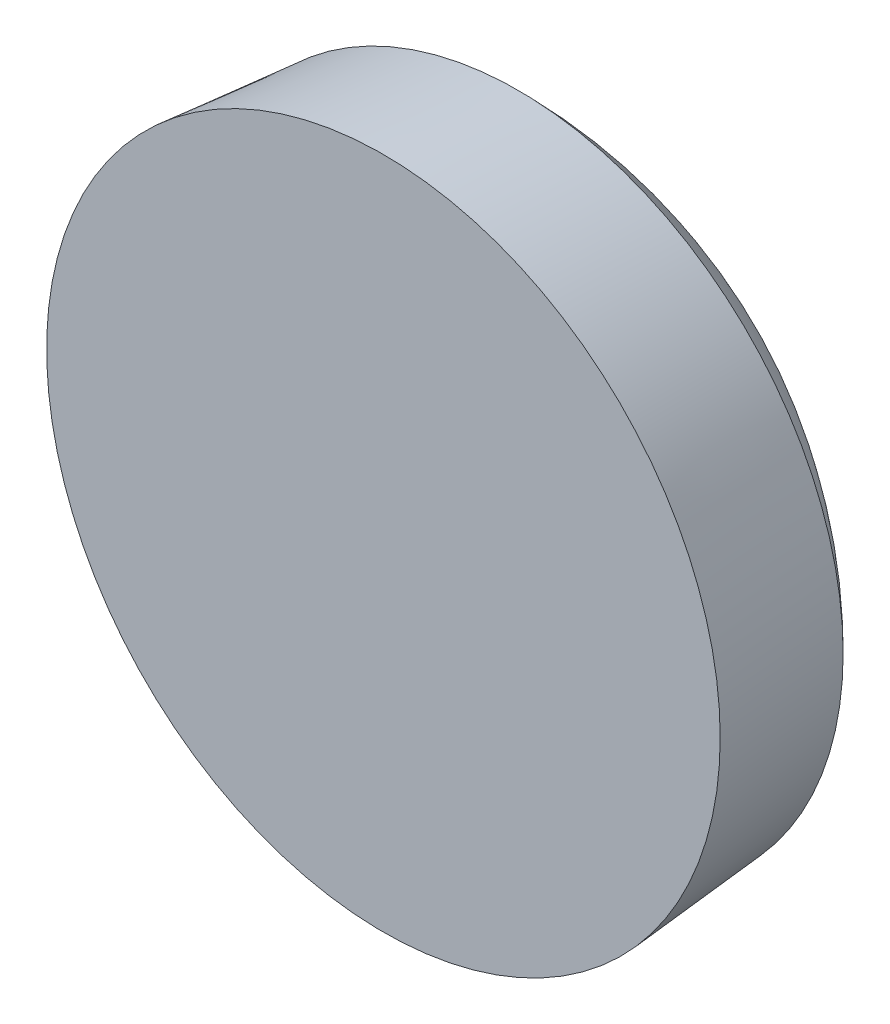
ISO-10303-21;
HEADER;
FILE_DESCRIPTION(('STEP AP214'),'2;1');
FILE_NAME('part.step','',(''),(''),'','','');
FILE_SCHEMA(('AUTOMOTIVE_DESIGN { 1 0 10303 214 1 1 1 1 }'));
ENDSEC;
DATA;
#1=APPLICATION_CONTEXT('core data for automotive mechanical design processes');
#2=APPLICATION_PROTOCOL_DEFINITION('international standard','automotive_design',2000,#1);
#3=PRODUCT_CONTEXT('',#1,'mechanical');
#4=PRODUCT('Part','Part','',(#3));
#5=PRODUCT_RELATED_PRODUCT_CATEGORY('part','',(#4));
#6=PRODUCT_DEFINITION_FORMATION('','',#4);
#7=PRODUCT_DEFINITION_CONTEXT('part definition',#1,'design');
#8=PRODUCT_DEFINITION('design','',#6,#7);
#9=PRODUCT_DEFINITION_SHAPE('','',#8);
#10=(LENGTH_UNIT() NAMED_UNIT(*) SI_UNIT(.MILLI.,.METRE.));
#11=(NAMED_UNIT(*) PLANE_ANGLE_UNIT() SI_UNIT($,.RADIAN.));
#12=(NAMED_UNIT(*) SI_UNIT($,.STERADIAN.) SOLID_ANGLE_UNIT());
#13=UNCERTAINTY_MEASURE_WITH_UNIT(LENGTH_MEASURE(1.E-05),#10,'distance_accuracy_value','');
#14=(GEOMETRIC_REPRESENTATION_CONTEXT(3) GLOBAL_UNCERTAINTY_ASSIGNED_CONTEXT((#13)) GLOBAL_UNIT_ASSIGNED_CONTEXT((#10,
#11,#12)) REPRESENTATION_CONTEXT('',''));
#15=CARTESIAN_POINT('',(0.,0.,0.));
#16=DIRECTION('',(0.,0.,1.));
#17=DIRECTION('',(1.,0.,0.));
#18=AXIS2_PLACEMENT_3D('',#15,#16,#17);
#19=CARTESIAN_POINT('',(-6.89997712496555,4.50501230247056,-21.6));
#20=DIRECTION('',(0.,0.,-1.));
#21=DIRECTION('',(0.,1.,0.));
#22=AXIS2_PLACEMENT_3D('',#19,#20,#21);
#23=PLANE('',#22);
#24=DIRECTION('',(0.747876143588401,0.66383828893138,0.));
#25=VECTOR('',#24,1.);
#26=CARTESIAN_POINT('',(-7.0194680169732,4.63963000831647,-21.6));
#27=LINE('',#26,#25);
#28=CARTESIAN_POINT('',(-7.15408572281911,4.52013911630882,-21.6));
#29=VERTEX_POINT('',#28);
#30=CARTESIAN_POINT('',(-7.72995035338218,4.00898363383166,-21.6));
#31=VERTEX_POINT('',#30);
#32=EDGE_CURVE('E84',#29,#31,#27,.F.);
#33=ORIENTED_EDGE('',*,*,#32,.F.);
#34=DIRECTION('',(-0.66383828893138,0.747876143588401,0.));
#35=VECTOR('',#34,1.);
#36=CARTESIAN_POINT('',(-7.03459483081146,4.38552141046291,-21.6));
#37=LINE('',#36,#35);
#38=CARTESIAN_POINT('',(-7.66524120529627,5.09600374687189,-21.6));
#39=VERTEX_POINT('',#38);
#40=EDGE_CURVE('E89',#39,#29,#37,.F.);
#41=ORIENTED_EDGE('',*,*,#40,.F.);
#42=DIRECTION('',(0.747876143588401,0.66383828893138,0.));
#43=VECTOR('',#42,1.);
#44=CARTESIAN_POINT('',(-7.53062349945036,5.21549463887954,-21.6));
#45=LINE('',#44,#43);
#46=CARTESIAN_POINT('',(-7.39600579360445,5.33498553088719,-21.6));
#47=VERTEX_POINT('',#46);
#48=EDGE_CURVE('E140',#47,#39,#45,.F.);
#49=ORIENTED_EDGE('',*,*,#48,.F.);
#50=DIRECTION('',(0.66383828893138,-0.747876143588401,0.));
#51=VECTOR('',#50,1.);
#52=CARTESIAN_POINT('',(-6.76535941911964,4.62450319447821,-21.6));
#53=LINE('',#52,#51);
#54=CARTESIAN_POINT('',(-6.88485031112729,4.75912090032412,-21.6));
#55=VERTEX_POINT('',#54);
#56=EDGE_CURVE('E151',#55,#47,#53,.F.);
#57=ORIENTED_EDGE('',*,*,#56,.F.);
#58=DIRECTION('',(0.747876143588401,0.66383828893138,0.));
#59=VECTOR('',#58,1.);
#60=CARTESIAN_POINT('',(-7.0194680169732,4.63963000831647,-21.6));
#61=LINE('',#60,#59);
#62=CARTESIAN_POINT('',(-6.30898568056422,5.27027638280128,-21.6));
#63=VERTEX_POINT('',#62);
#64=EDGE_CURVE('E154',#63,#55,#61,.F.);
#65=ORIENTED_EDGE('',*,*,#64,.F.);
#66=DIRECTION('',(0.66383828893138,-0.747876143588401,0.));
#67=VECTOR('',#66,1.);
#68=CARTESIAN_POINT('',(-6.18949478855657,5.13565867695537,-21.6));
#69=LINE('',#68,#67);
#70=CARTESIAN_POINT('',(-6.07000389654892,5.00104097110945,-21.6));
#71=VERTEX_POINT('',#70);
#72=EDGE_CURVE('E162',#71,#63,#69,.F.);
#73=ORIENTED_EDGE('',*,*,#72,.F.);
#74=DIRECTION('',(-0.747876143588401,-0.66383828893138,0.));
#75=VECTOR('',#74,1.);
#76=CARTESIAN_POINT('',(-6.7804862329579,4.37039459662465,-21.6));
#77=LINE('',#76,#75);
#78=CARTESIAN_POINT('',(-6.64586852711199,4.4898854886323,-21.6));
#79=VERTEX_POINT('',#78);
#80=EDGE_CURVE('E167',#79,#71,#77,.F.);
#81=ORIENTED_EDGE('',*,*,#80,.F.);
#82=DIRECTION('',(0.66383828893138,-0.747876143588401,0.));
#83=VECTOR('',#82,1.);
#84=CARTESIAN_POINT('',(-6.76535941911964,4.62450319447821,-21.6));
#85=LINE('',#84,#83);
#86=CARTESIAN_POINT('',(-6.13471304463483,3.91402085806923,-21.6));
#87=VERTEX_POINT('',#86);
#88=EDGE_CURVE('E172',#87,#79,#85,.F.);
#89=ORIENTED_EDGE('',*,*,#88,.F.);
#90=DIRECTION('',(0.747876143588401,0.66383828893138,0.));
#91=VECTOR('',#90,1.);
#92=CARTESIAN_POINT('',(-6.26933075048074,3.79452996606158,-21.6));
#93=LINE('',#92,#91);
#94=CARTESIAN_POINT('',(-6.40394845632666,3.67503907405393,-21.6));
#95=VERTEX_POINT('',#94);
#96=EDGE_CURVE('E178',#87,#95,#93,.F.);
#97=ORIENTED_EDGE('',*,*,#96,.T.);
#98=DIRECTION('',(-0.66383828893138,0.747876143588401,0.));
#99=VECTOR('',#98,1.);
#100=CARTESIAN_POINT('',(-7.03459483081146,4.38552141046291,-21.6));
#101=LINE('',#100,#99);
#102=CARTESIAN_POINT('',(-6.91510393880381,4.250903704617,-21.6));
#103=VERTEX_POINT('',#102);
#104=EDGE_CURVE('E183',#103,#95,#101,.F.);
#105=ORIENTED_EDGE('',*,*,#104,.F.);
#106=DIRECTION('',(-0.747876143588401,-0.66383828893138,0.));
#107=VECTOR('',#106,1.);
#108=CARTESIAN_POINT('',(-6.7804862329579,4.37039459662465,-21.6));
#109=LINE('',#108,#107);
#110=CARTESIAN_POINT('',(-7.49096856936688,3.73974822213984,-21.6));
#111=VERTEX_POINT('',#110);
#112=EDGE_CURVE('E119',#111,#103,#109,.F.);
#113=ORIENTED_EDGE('',*,*,#112,.F.);
#114=DIRECTION('',(0.66383828893138,-0.747876143588401,0.));
#115=VECTOR('',#114,1.);
#116=CARTESIAN_POINT('',(-7.61045946137453,3.87436592798575,-21.6));
#117=LINE('',#116,#115);
#118=EDGE_CURVE('E117',#111,#31,#117,.F.);
#119=ORIENTED_EDGE('',*,*,#118,.T.);
#120=EDGE_LOOP('',(#33,#41,#49,#57,#65,#73,#81,#89,#97,#105,#113,#119));
#121=FACE_BOUND('',#120,.T.);
#122=ADVANCED_FACE('F17',(#121),#23,.T.);
#123=CARTESIAN_POINT('',(-7.0194680169732,4.63963000831647,-22.2));
#124=DIRECTION('',(0.66383828893138,-0.747876143588401,0.));
#125=DIRECTION('',(0.747876143588401,0.66383828893138,0.));
#126=AXIS2_PLACEMENT_3D('',#123,#124,#125);
#127=PLANE('',#126);
#128=DIRECTION('',(0.,0.,1.));
#129=VECTOR('',#128,1.);
#130=CARTESIAN_POINT('',(-7.15408572281911,4.52013911630882,-22.2));
#131=LINE('',#130,#129);
#132=CARTESIAN_POINT('',(-7.15408572281911,4.52013911630882,-22.788097569794));
#133=VERTEX_POINT('',#132);
#134=EDGE_CURVE('E127',#29,#133,#131,.F.);
#135=ORIENTED_EDGE('',*,*,#134,.F.);
#136=ORIENTED_EDGE('',*,*,#32,.T.);
#137=DIRECTION('',(0.,0.,1.));
#138=VECTOR('',#137,1.);
#139=CARTESIAN_POINT('',(-7.72995035338218,4.00898363383166,-22.2));
#140=LINE('',#139,#138);
#141=CARTESIAN_POINT('',(-7.72995035338218,4.00898363383166,-22.6229045231911));
#142=VERTEX_POINT('',#141);
#143=EDGE_CURVE('E123',#31,#142,#140,.F.);
#144=ORIENTED_EDGE('',*,*,#143,.T.);
#145=CARTESIAN_POINT('',(-7.15408572281911,4.52013911630882,-22.788097569794));
#146=CARTESIAN_POINT('',(-7.178771656599,4.49822710830909,-22.7859104299673));
#147=CARTESIAN_POINT('',(-7.20342772135599,4.4763416129896,-22.7831210421487));
#148=CARTESIAN_POINT('',(-7.25255070327682,4.43273851567851,-22.7763560552392));
#149=CARTESIAN_POINT('',(-7.27701798297534,4.41102059188977,-22.7723851623111));
#150=CARTESIAN_POINT('',(-7.32576464164366,4.36775153088425,-22.7632701136372));
#151=CARTESIAN_POINT('',(-7.35004434494988,4.3462001057763,-22.7581290588921));
#152=CARTESIAN_POINT('',(-7.39841672115628,4.30326326960671,-22.7466823115268));
#153=CARTESIAN_POINT('',(-7.42250959829504,4.2818776772565,-22.7403781619621));
#154=CARTESIAN_POINT('',(-7.47050909335735,4.23927182206925,-22.7266089835755));
#155=CARTESIAN_POINT('',(-7.49441571128089,4.2180515592322,-22.7191439547536));
#156=CARTESIAN_POINT('',(-7.5420428123996,4.17577625257286,-22.703052205587));
#157=CARTESIAN_POINT('',(-7.56576300849104,4.15472146359282,-22.6944239659575));
#158=CARTESIAN_POINT('',(-7.61301615058749,4.11277809467423,-22.6760004253173));
#159=CARTESIAN_POINT('',(-7.63654844108106,4.09189009658817,-22.666202118307));
#160=CARTESIAN_POINT('',(-7.68342385204351,4.05028201365486,-22.6454289197685));
#161=CARTESIAN_POINT('',(-7.70676585941599,4.02956291682684,-22.6344495373844));
#162=CARTESIAN_POINT('',(-7.72995035338216,4.00898363383167,-22.622904523191));
#163=B_SPLINE_CURVE_WITH_KNOTS('',3,(#145,#146,#147,#148,#149,#150,#151,#152,#153,#154,#155,
#156,#157,#158,#159,#160,#161,#162),.UNSPECIFIED.,.F.,.F.,(4,2,2,2,2,2,2,2,4),(0.,
0.0992357442434154,0.198081387639265,0.296668072480489,0.395124892694088,0.493581712907687,
0.592168397748912,0.691014041144761,0.790249785388177),.UNSPECIFIED.);
#164=EDGE_CURVE('E20',#133,#142,#163,.T.);
#165=ORIENTED_EDGE('',*,*,#164,.F.);
#166=EDGE_LOOP('',(#135,#136,#144,#165));
#167=FACE_BOUND('',#166,.T.);
#168=ADVANCED_FACE('F125',(#167),#127,.T.);
#169=CARTESIAN_POINT('',(-7.61045946137453,3.87436592798575,-22.2));
#170=DIRECTION('',(-0.747876143588401,-0.66383828893138,0.));
#171=DIRECTION('',(0.66383828893138,-0.747876143588401,0.));
#172=AXIS2_PLACEMENT_3D('',#169,#170,#171);
#173=PLANE('',#172);
#174=ORIENTED_EDGE('',*,*,#118,.F.);
#175=DIRECTION('',(0.,0.,1.));
#176=VECTOR('',#175,1.);
#177=CARTESIAN_POINT('',(-7.49096856936688,3.73974822213984,-22.2));
#178=LINE('',#177,#176);
#179=CARTESIAN_POINT('',(-7.49096856936687,3.73974822213985,-22.6229045231911));
#180=VERTEX_POINT('',#179);
#181=EDGE_CURVE('E132',#180,#111,#178,.T.);
#182=ORIENTED_EDGE('',*,*,#181,.F.);
#183=CARTESIAN_POINT('',(-7.72995035338218,4.00898363383166,-22.622904523191));
#184=CARTESIAN_POINT('',(-7.69012005604629,3.96411106521636,-22.6271329188894));
#185=CARTESIAN_POINT('',(-7.65028975871041,3.91923849660105,-22.6292471167385));
#186=CARTESIAN_POINT('',(-7.57062916403865,3.82949335937045,-22.6292471167385));
#187=CARTESIAN_POINT('',(-7.53079886670277,3.78462079075514,-22.6271329188894));
#188=CARTESIAN_POINT('',(-7.49096856936689,3.73974822213984,-22.622904523191));
#189=B_SPLINE_CURVE_WITH_KNOTS('',3,(#183,#184,#185,#186,#187,#188),.UNSPECIFIED.,.F.,.F.,(4,2,
4),(0.,0.180111711148683,0.360223422297367),.UNSPECIFIED.);
#190=EDGE_CURVE('E131',#142,#180,#189,.T.);
#191=ORIENTED_EDGE('',*,*,#190,.F.);
#192=ORIENTED_EDGE('',*,*,#143,.F.);
#193=EDGE_LOOP('',(#174,#182,#191,#192));
#194=FACE_BOUND('',#193,.T.);
#195=ADVANCED_FACE('F129',(#194),#173,.F.);
#196=CARTESIAN_POINT('',(-6.7804862329579,4.37039459662465,-22.2));
#197=DIRECTION('',(-0.66383828893138,0.747876143588401,0.));
#198=DIRECTION('',(-0.747876143588401,-0.66383828893138,0.));
#199=AXIS2_PLACEMENT_3D('',#196,#197,#198);
#200=PLANE('',#199);
#201=DIRECTION('',(0.,0.,1.));
#202=VECTOR('',#201,1.);
#203=CARTESIAN_POINT('',(-6.91510393880381,4.250903704617,-22.2));
#204=LINE('',#203,#202);
#205=CARTESIAN_POINT('',(-6.91510393880381,4.250903704617,-22.788097569794));
#206=VERTEX_POINT('',#205);
#207=EDGE_CURVE('E180',#206,#103,#204,.T.);
#208=ORIENTED_EDGE('',*,*,#207,.F.);
#209=CARTESIAN_POINT('',(-7.49096856936687,3.73974822213985,-22.622904523191));
#210=CARTESIAN_POINT('',(-7.46778407540069,3.76032750513502,-22.6344495373844));
#211=CARTESIAN_POINT('',(-7.44444206802821,3.78104660196304,-22.6454289197685));
#212=CARTESIAN_POINT('',(-7.39756665706576,3.82265468489635,-22.666202118307));
#213=CARTESIAN_POINT('',(-7.37403436657219,3.84354268298241,-22.6760004253173));
#214=CARTESIAN_POINT('',(-7.32678122447574,3.885486051901,-22.6944239659575));
#215=CARTESIAN_POINT('',(-7.3030610283843,3.90654084088104,-22.703052205587));
#216=CARTESIAN_POINT('',(-7.25543392726559,3.94881614754038,-22.7191439547536));
#217=CARTESIAN_POINT('',(-7.23152730934205,3.97003641037742,-22.7266089835755));
#218=CARTESIAN_POINT('',(-7.18352781427975,4.01264226556468,-22.7403781619621));
#219=CARTESIAN_POINT('',(-7.15943493714099,4.03402785791489,-22.7466823115268));
#220=CARTESIAN_POINT('',(-7.11106256093458,4.07696469408448,-22.7581290588921));
#221=CARTESIAN_POINT('',(-7.08678285762836,4.09851611919243,-22.7632701136372));
#222=CARTESIAN_POINT('',(-7.03803619896004,4.14178518019794,-22.7723851623111));
#223=CARTESIAN_POINT('',(-7.01356891926152,4.16350310398668,-22.7763560552392));
#224=CARTESIAN_POINT('',(-6.96444593734069,4.20710620129778,-22.7831210421487));
#225=CARTESIAN_POINT('',(-6.93978987258371,4.22899169661726,-22.7859104299673));
#226=CARTESIAN_POINT('',(-6.91510393880382,4.250903704617,-22.788097569794));
#227=B_SPLINE_CURVE_WITH_KNOTS('',3,(#209,#210,#211,#212,#213,#214,#215,#216,#217,#218,#219,
#220,#221,#222,#223,#224,#225,#226),.UNSPECIFIED.,.F.,.F.,(4,2,2,2,2,2,2,2,4),(0.,
0.0992357442434155,0.198081387639263,0.296668072480486,0.395124892694085,0.493581712907682,
0.592168397748907,0.691014041144755,0.790249785388171),.UNSPECIFIED.);
#228=EDGE_CURVE('E296',#180,#206,#227,.T.);
#229=ORIENTED_EDGE('',*,*,#228,.F.);
#230=ORIENTED_EDGE('',*,*,#181,.T.);
#231=ORIENTED_EDGE('',*,*,#112,.T.);
#232=EDGE_LOOP('',(#208,#229,#230,#231));
#233=FACE_BOUND('',#232,.T.);
#234=ADVANCED_FACE('F305',(#233),#200,.T.);
#235=CARTESIAN_POINT('',(-7.03459483081146,4.38552141046291,-22.2));
#236=DIRECTION('',(0.747876143588401,0.66383828893138,0.));
#237=DIRECTION('',(-0.66383828893138,0.747876143588401,0.));
#238=AXIS2_PLACEMENT_3D('',#235,#236,#237);
#239=PLANE('',#238);
#240=CARTESIAN_POINT('',(-6.91510393880381,4.250903704617,-22.788097569794));
#241=CARTESIAN_POINT('',(-6.89319193080408,4.2262177708371,-22.7859104299673));
#242=CARTESIAN_POINT('',(-6.8713064354846,4.20156170608012,-22.7831210421487));
#243=CARTESIAN_POINT('',(-6.8277033381735,4.15243872415929,-22.7763560552392));
#244=CARTESIAN_POINT('',(-6.80598541438476,4.12797144446077,-22.7723851623111));
#245=CARTESIAN_POINT('',(-6.76271635337924,4.07922478579245,-22.7632701136372));
#246=CARTESIAN_POINT('',(-6.7411649282713,4.05494508248623,-22.7581290588921));
#247=CARTESIAN_POINT('',(-6.6982280921017,4.00657270627983,-22.7466823115268));
#248=CARTESIAN_POINT('',(-6.67684249975149,3.98247982914107,-22.7403781619621));
#249=CARTESIAN_POINT('',(-6.63423664456424,3.93448033407876,-22.7266089835755));
#250=CARTESIAN_POINT('',(-6.61301638172719,3.91057371615522,-22.7191439547536));
#251=CARTESIAN_POINT('',(-6.57074107506785,3.86294661503651,-22.703052205587));
#252=CARTESIAN_POINT('',(-6.54968628608781,3.83922641894507,-22.6944239659575));
#253=CARTESIAN_POINT('',(-6.50774291716923,3.79197327684862,-22.6760004253173));
#254=CARTESIAN_POINT('',(-6.48685491908316,3.76844098635505,-22.666202118307));
#255=CARTESIAN_POINT('',(-6.44524683614985,3.7215655753926,-22.6454289197685));
#256=CARTESIAN_POINT('',(-6.42452773932184,3.69822356802012,-22.6344495373844));
#257=CARTESIAN_POINT('',(-6.40394845632667,3.67503907405395,-22.622904523191));
#258=B_SPLINE_CURVE_WITH_KNOTS('',3,(#240,#241,#242,#243,#244,#245,#246,#247,#248,#249,#250,
#251,#252,#253,#254,#255,#256,#257),.UNSPECIFIED.,.F.,.F.,(4,2,2,2,2,2,2,2,4),(0.,
0.0992357442434143,0.198081387639264,0.296668072480489,0.395124892694087,0.493581712907685,
0.592168397748907,0.691014041144758,0.790249785388172),.UNSPECIFIED.);
#259=CARTESIAN_POINT('',(-6.40394845632665,3.67503907405393,-22.6229045231911));
#260=VERTEX_POINT('',#259);
#261=EDGE_CURVE('E289',#206,#260,#258,.T.);
#262=ORIENTED_EDGE('',*,*,#261,.F.);
#263=ORIENTED_EDGE('',*,*,#207,.T.);
#264=ORIENTED_EDGE('',*,*,#104,.T.);
#265=DIRECTION('',(0.,0.,1.));
#266=VECTOR('',#265,1.);
#267=CARTESIAN_POINT('',(-6.40394845632666,3.67503907405393,-22.2));
#268=LINE('',#267,#266);
#269=EDGE_CURVE('E175',#95,#260,#268,.F.);
#270=ORIENTED_EDGE('',*,*,#269,.T.);
#271=EDGE_LOOP('',(#262,#263,#264,#270));
#272=FACE_BOUND('',#271,.T.);
#273=ADVANCED_FACE('F302',(#272),#239,.T.);
#274=CARTESIAN_POINT('',(-6.26933075048074,3.79452996606158,-22.2));
#275=DIRECTION('',(0.66383828893138,-0.747876143588401,0.));
#276=DIRECTION('',(0.747876143588401,0.66383828893138,0.));
#277=AXIS2_PLACEMENT_3D('',#274,#275,#276);
#278=PLANE('',#277);
#279=ORIENTED_EDGE('',*,*,#96,.F.);
#280=DIRECTION('',(0.,0.,1.));
#281=VECTOR('',#280,1.);
#282=CARTESIAN_POINT('',(-6.13471304463483,3.91402085806923,-22.2));
#283=LINE('',#282,#281);
#284=CARTESIAN_POINT('',(-6.13471304463484,3.91402085806924,-22.6229045231911));
#285=VERTEX_POINT('',#284);
#286=EDGE_CURVE('E174',#285,#87,#283,.T.);
#287=ORIENTED_EDGE('',*,*,#286,.F.);
#288=CARTESIAN_POINT('',(-6.40394845632665,3.67503907405393,-22.622904523191));
#289=CARTESIAN_POINT('',(-6.35907588771135,3.71486937138982,-22.6271329188894));
#290=CARTESIAN_POINT('',(-6.31420331909604,3.7546996687257,-22.6292471167385));
#291=CARTESIAN_POINT('',(-6.22445818186544,3.83436026339746,-22.6292471167385));
#292=CARTESIAN_POINT('',(-6.17958561325013,3.87419056073334,-22.6271329188894));
#293=CARTESIAN_POINT('',(-6.13471304463483,3.91402085806922,-22.622904523191));
#294=B_SPLINE_CURVE_WITH_KNOTS('',3,(#288,#289,#290,#291,#292,#293),.UNSPECIFIED.,.F.,.F.,(4,2,
4),(0.,0.180111711148684,0.360223422297368),.UNSPECIFIED.);
#295=EDGE_CURVE('E282',#260,#285,#294,.T.);
#296=ORIENTED_EDGE('',*,*,#295,.F.);
#297=ORIENTED_EDGE('',*,*,#269,.F.);
#298=EDGE_LOOP('',(#279,#287,#296,#297));
#299=FACE_BOUND('',#298,.T.);
#300=ADVANCED_FACE('F271',(#299),#278,.F.);
#301=CARTESIAN_POINT('',(-6.76535941911964,4.62450319447821,-22.2));
#302=DIRECTION('',(-0.747876143588401,-0.66383828893138,0.));
#303=DIRECTION('',(0.66383828893138,-0.747876143588401,0.));
#304=AXIS2_PLACEMENT_3D('',#301,#302,#303);
#305=PLANE('',#304);
#306=CARTESIAN_POINT('',(-6.13471304463484,3.91402085806925,-22.622904523191));
#307=CARTESIAN_POINT('',(-6.15529232763002,3.93720535203542,-22.6344495373844));
#308=CARTESIAN_POINT('',(-6.17601142445803,3.9605473594079,-22.6454289197685));
#309=CARTESIAN_POINT('',(-6.21761950739134,4.00742277037035,-22.666202118307));
#310=CARTESIAN_POINT('',(-6.2385075054774,4.03095506086392,-22.6760004253173));
#311=CARTESIAN_POINT('',(-6.28045087439599,4.07820820296037,-22.6944239659575));
#312=CARTESIAN_POINT('',(-6.30150566337603,4.10192839905181,-22.703052205587));
#313=CARTESIAN_POINT('',(-6.34378097003537,4.14955550017052,-22.7191439547536));
#314=CARTESIAN_POINT('',(-6.36500123287241,4.17346211809406,-22.7266089835755));
#315=CARTESIAN_POINT('',(-6.40760708805967,4.22146161315637,-22.7403781619621));
#316=CARTESIAN_POINT('',(-6.42899268040988,4.24555449029512,-22.7466823115268));
#317=CARTESIAN_POINT('',(-6.47192951657947,4.29392686650153,-22.7581290588921));
#318=CARTESIAN_POINT('',(-6.49348094168742,4.31820656980775,-22.7632701136372));
#319=CARTESIAN_POINT('',(-6.53675000269294,4.36695322847607,-22.7723851623111));
#320=CARTESIAN_POINT('',(-6.55846792648168,4.39142050817459,-22.7763560552392));
#321=CARTESIAN_POINT('',(-6.60207102379277,4.44054349009542,-22.7831210421487));
#322=CARTESIAN_POINT('',(-6.62395651911226,4.4651995548524,-22.7859104299673));
#323=CARTESIAN_POINT('',(-6.64586852711199,4.4898854886323,-22.788097569794));
#324=B_SPLINE_CURVE_WITH_KNOTS('',3,(#306,#307,#308,#309,#310,#311,#312,#313,#314,#315,#316,
#317,#318,#319,#320,#321,#322,#323),.UNSPECIFIED.,.F.,.F.,(4,2,2,2,2,2,2,2,4),(0.,
0.0992357442434156,0.198081387639265,0.296668072480489,0.395124892694088,0.493581712907686,
0.592168397748911,0.69101404114476,0.790249785388176),.UNSPECIFIED.);
#325=CARTESIAN_POINT('',(-6.64586852711199,4.4898854886323,-22.788097569794));
#326=VERTEX_POINT('',#325);
#327=EDGE_CURVE('E275',#285,#326,#324,.T.);
#328=ORIENTED_EDGE('',*,*,#327,.F.);
#329=ORIENTED_EDGE('',*,*,#286,.T.);
#330=ORIENTED_EDGE('',*,*,#88,.T.);
#331=DIRECTION('',(0.,0.,1.));
#332=VECTOR('',#331,1.);
#333=CARTESIAN_POINT('',(-6.64586852711199,4.4898854886323,-22.2));
#334=LINE('',#333,#332);
#335=EDGE_CURVE('E169',#326,#79,#334,.T.);
#336=ORIENTED_EDGE('',*,*,#335,.F.);
#337=EDGE_LOOP('',(#328,#329,#330,#336));
#338=FACE_BOUND('',#337,.T.);
#339=ADVANCED_FACE('F266',(#338),#305,.T.);
#340=CARTESIAN_POINT('',(-6.7804862329579,4.37039459662465,-22.2));
#341=DIRECTION('',(-0.66383828893138,0.747876143588401,0.));
#342=DIRECTION('',(-0.747876143588401,-0.66383828893138,0.));
#343=AXIS2_PLACEMENT_3D('',#340,#341,#342);
#344=PLANE('',#343);
#345=ORIENTED_EDGE('',*,*,#335,.T.);
#346=ORIENTED_EDGE('',*,*,#80,.T.);
#347=DIRECTION('',(0.,0.,1.));
#348=VECTOR('',#347,1.);
#349=CARTESIAN_POINT('',(-6.07000389654892,5.00104097110945,-22.2));
#350=LINE('',#349,#348);
#351=CARTESIAN_POINT('',(-6.07000389654892,5.00104097110945,-22.6229045231911));
#352=VERTEX_POINT('',#351);
#353=EDGE_CURVE('E164',#352,#71,#350,.T.);
#354=ORIENTED_EDGE('',*,*,#353,.F.);
#355=CARTESIAN_POINT('',(-6.64586852711199,4.4898854886323,-22.788097569794));
#356=CARTESIAN_POINT('',(-6.62118259333209,4.51179749663203,-22.7859104299673));
#357=CARTESIAN_POINT('',(-6.59652652857511,4.53368299195151,-22.7831210421487));
#358=CARTESIAN_POINT('',(-6.54740354665428,4.57728608926261,-22.7763560552392));
#359=CARTESIAN_POINT('',(-6.52293626695576,4.59900401305135,-22.7723851623111));
#360=CARTESIAN_POINT('',(-6.47418960828744,4.64227307405686,-22.7632701136372));
#361=CARTESIAN_POINT('',(-6.44990990498122,4.66382449916481,-22.7581290588921));
#362=CARTESIAN_POINT('',(-6.40153752877482,4.70676133533441,-22.7466823115268));
#363=CARTESIAN_POINT('',(-6.37744465163606,4.72814692768462,-22.740378161962));
#364=CARTESIAN_POINT('',(-6.32944515657375,4.77075278287187,-22.7266089835755));
#365=CARTESIAN_POINT('',(-6.30553853865021,4.79197304570892,-22.7191439547536));
#366=CARTESIAN_POINT('',(-6.2579114375315,4.83424835236825,-22.703052205587));
#367=CARTESIAN_POINT('',(-6.23419124144006,4.8553031413483,-22.6944239659575));
#368=CARTESIAN_POINT('',(-6.18693809934361,4.89724651026688,-22.6760004253173));
#369=CARTESIAN_POINT('',(-6.16340580885004,4.91813450835295,-22.666202118307));
#370=CARTESIAN_POINT('',(-6.11653039788759,4.95974259128625,-22.6454289197685));
#371=CARTESIAN_POINT('',(-6.09318839051511,4.98046168811427,-22.6344495373844));
#372=CARTESIAN_POINT('',(-6.07000389654894,5.00104097110944,-22.622904523191));
#373=B_SPLINE_CURVE_WITH_KNOTS('',3,(#355,#356,#357,#358,#359,#360,#361,#362,#363,#364,#365,
#366,#367,#368,#369,#370,#371,#372),.UNSPECIFIED.,.F.,.F.,(4,2,2,2,2,2,2,2,4),(0.,
0.0992357442434139,0.198081387639264,0.296668072480488,0.395124892694086,0.493581712907684,
0.592168397748906,0.691014041144755,0.790249785388169),.UNSPECIFIED.);
#374=EDGE_CURVE('E251',#326,#352,#373,.T.);
#375=ORIENTED_EDGE('',*,*,#374,.F.);
#376=EDGE_LOOP('',(#345,#346,#354,#375));
#377=FACE_BOUND('',#376,.T.);
#378=ADVANCED_FACE('F261',(#377),#344,.T.);
#379=CARTESIAN_POINT('',(-6.18949478855657,5.13565867695537,-22.2));
#380=DIRECTION('',(-0.747876143588401,-0.66383828893138,0.));
#381=DIRECTION('',(0.66383828893138,-0.747876143588401,0.));
#382=AXIS2_PLACEMENT_3D('',#379,#380,#381);
#383=PLANE('',#382);
#384=ORIENTED_EDGE('',*,*,#353,.T.);
#385=ORIENTED_EDGE('',*,*,#72,.T.);
#386=DIRECTION('',(0.,0.,1.));
#387=VECTOR('',#386,1.);
#388=CARTESIAN_POINT('',(-6.30898568056422,5.27027638280128,-22.2));
#389=LINE('',#388,#387);
#390=CARTESIAN_POINT('',(-6.30898568056423,5.27027638280127,-22.6229045231911));
#391=VERTEX_POINT('',#390);
#392=EDGE_CURVE('E159',#391,#63,#389,.T.);
#393=ORIENTED_EDGE('',*,*,#392,.F.);
#394=CARTESIAN_POINT('',(-6.07000389654892,5.00104097110946,-22.622904523191));
#395=CARTESIAN_POINT('',(-6.1098341938848,5.04591353972476,-22.6271329188894));
#396=CARTESIAN_POINT('',(-6.14966449122069,5.09078610834006,-22.6292471167385));
#397=CARTESIAN_POINT('',(-6.22932508589245,5.18053124557067,-22.6292471167385));
#398=CARTESIAN_POINT('',(-6.26915538322833,5.22540381418598,-22.6271329188894));
#399=CARTESIAN_POINT('',(-6.30898568056421,5.27027638280128,-22.622904523191));
#400=B_SPLINE_CURVE_WITH_KNOTS('',3,(#394,#395,#396,#397,#398,#399),.UNSPECIFIED.,.F.,.F.,(4,2,
4),(0.,0.180111711148687,0.360223422297376),.UNSPECIFIED.);
#401=EDGE_CURVE('E244',#352,#391,#400,.T.);
#402=ORIENTED_EDGE('',*,*,#401,.F.);
#403=EDGE_LOOP('',(#384,#385,#393,#402));
#404=FACE_BOUND('',#403,.T.);
#405=ADVANCED_FACE('F258',(#404),#383,.T.);
#406=CARTESIAN_POINT('',(-7.0194680169732,4.63963000831647,-22.2));
#407=DIRECTION('',(0.66383828893138,-0.747876143588401,0.));
#408=DIRECTION('',(0.747876143588401,0.66383828893138,0.));
#409=AXIS2_PLACEMENT_3D('',#406,#407,#408);
#410=PLANE('',#409);
#411=DIRECTION('',(0.,0.,1.));
#412=VECTOR('',#411,1.);
#413=CARTESIAN_POINT('',(-6.88485031112729,4.75912090032412,-22.2));
#414=LINE('',#413,#412);
#415=CARTESIAN_POINT('',(-6.88485031112729,4.75912090032412,-22.788097569794));
#416=VERTEX_POINT('',#415);
#417=EDGE_CURVE('E143',#416,#55,#414,.T.);
#418=ORIENTED_EDGE('',*,*,#417,.F.);
#419=CARTESIAN_POINT('',(-6.30898568056424,5.27027638280126,-22.622904523191));
#420=CARTESIAN_POINT('',(-6.33217017453041,5.24969709980609,-22.6344495373844));
#421=CARTESIAN_POINT('',(-6.35551218190288,5.22897800297808,-22.6454289197685));
#422=CARTESIAN_POINT('',(-6.40238759286534,5.18736992004477,-22.666202118307));
#423=CARTESIAN_POINT('',(-6.42591988335891,5.16648192195871,-22.6760004253173));
#424=CARTESIAN_POINT('',(-6.47317302545536,5.12453855304012,-22.6944239659575));
#425=CARTESIAN_POINT('',(-6.4968932215468,5.10348376406008,-22.703052205587));
#426=CARTESIAN_POINT('',(-6.54452032266551,5.06120845740074,-22.7191439547536));
#427=CARTESIAN_POINT('',(-6.56842694058905,5.03998819456369,-22.7266089835755));
#428=CARTESIAN_POINT('',(-6.61642643565135,4.99738233937644,-22.7403781619621));
#429=CARTESIAN_POINT('',(-6.64051931279011,4.97599674702623,-22.7466823115268));
#430=CARTESIAN_POINT('',(-6.68889168899652,4.93305991085664,-22.7581290588921));
#431=CARTESIAN_POINT('',(-6.71317139230274,4.91150848574869,-22.7632701136372));
#432=CARTESIAN_POINT('',(-6.76191805097105,4.86823942474317,-22.7723851623111));
#433=CARTESIAN_POINT('',(-6.78638533066957,4.84652150095443,-22.7763560552392));
#434=CARTESIAN_POINT('',(-6.83550831259041,4.80291840364333,-22.7831210421487));
#435=CARTESIAN_POINT('',(-6.86016437734739,4.78103290832385,-22.7859104299673));
#436=CARTESIAN_POINT('',(-6.88485031112728,4.75912090032412,-22.788097569794));
#437=B_SPLINE_CURVE_WITH_KNOTS('',3,(#419,#420,#421,#422,#423,#424,#425,#426,#427,#428,#429,
#430,#431,#432,#433,#434,#435,#436),.UNSPECIFIED.,.F.,.F.,(4,2,2,2,2,2,2,2,4),(0.,
0.099235744243414,0.198081387639265,0.296668072480487,0.395124892694085,0.493581712907683,
0.592168397748908,0.691014041144758,0.790249785388172),.UNSPECIFIED.);
#438=EDGE_CURVE('E237',#391,#416,#437,.T.);
#439=ORIENTED_EDGE('',*,*,#438,.F.);
#440=ORIENTED_EDGE('',*,*,#392,.T.);
#441=ORIENTED_EDGE('',*,*,#64,.T.);
#442=EDGE_LOOP('',(#418,#439,#440,#441));
#443=FACE_BOUND('',#442,.T.);
#444=ADVANCED_FACE('F226',(#443),#410,.T.);
#445=CARTESIAN_POINT('',(-6.76535941911964,4.62450319447821,-22.2));
#446=DIRECTION('',(-0.747876143588401,-0.66383828893138,0.));
#447=DIRECTION('',(0.66383828893138,-0.747876143588401,0.));
#448=AXIS2_PLACEMENT_3D('',#445,#446,#447);
#449=PLANE('',#448);
#450=CARTESIAN_POINT('',(-6.88485031112729,4.75912090032412,-22.788097569794));
#451=CARTESIAN_POINT('',(-6.90676231912702,4.78380683410401,-22.7859104299673));
#452=CARTESIAN_POINT('',(-6.9286478144465,4.808462898861,-22.7831210421487));
#453=CARTESIAN_POINT('',(-6.9722509117576,4.85758588078183,-22.7763560552392));
#454=CARTESIAN_POINT('',(-6.99396883554634,4.88205316048035,-22.7723851623111));
#455=CARTESIAN_POINT('',(-7.03723789655186,4.93079981914866,-22.7632701136372));
#456=CARTESIAN_POINT('',(-7.0587893216598,4.95507952245489,-22.7581290588921));
#457=CARTESIAN_POINT('',(-7.1017261578294,5.00345189866129,-22.7466823115268));
#458=CARTESIAN_POINT('',(-7.1231117501796,5.02754477580005,-22.7403781619621));
#459=CARTESIAN_POINT('',(-7.16571760536686,5.07554427086235,-22.7266089835755));
#460=CARTESIAN_POINT('',(-7.1869378682039,5.09945088878589,-22.7191439547536));
#461=CARTESIAN_POINT('',(-7.22921317486324,5.1470779899046,-22.703052205587));
#462=CARTESIAN_POINT('',(-7.25026796384328,5.17079818599605,-22.6944239659575));
#463=CARTESIAN_POINT('',(-7.29221133276187,5.21805132809249,-22.6760004253173));
#464=CARTESIAN_POINT('',(-7.31309933084793,5.24158361858606,-22.666202118307));
#465=CARTESIAN_POINT('',(-7.35470741378124,5.28845902954851,-22.6454289197685));
#466=CARTESIAN_POINT('',(-7.37542651060925,5.31180103692099,-22.6344495373844));
#467=CARTESIAN_POINT('',(-7.39600579360443,5.33498553088716,-22.622904523191));
#468=B_SPLINE_CURVE_WITH_KNOTS('',3,(#450,#451,#452,#453,#454,#455,#456,#457,#458,#459,#460,
#461,#462,#463,#464,#465,#466,#467),.UNSPECIFIED.,.F.,.F.,(4,2,2,2,2,2,2,2,4),(0.,
0.0992357442434128,0.198081387639263,0.296668072480485,0.395124892694082,0.493581712907678,
0.592168397748903,0.691014041144749,0.790249785388163),.UNSPECIFIED.);
#469=CARTESIAN_POINT('',(-7.39600579360445,5.33498553088718,-22.6229045231911));
#470=VERTEX_POINT('',#469);
#471=EDGE_CURVE('E230',#416,#470,#468,.T.);
#472=ORIENTED_EDGE('',*,*,#471,.F.);
#473=ORIENTED_EDGE('',*,*,#417,.T.);
#474=ORIENTED_EDGE('',*,*,#56,.T.);
#475=DIRECTION('',(0.,0.,1.));
#476=VECTOR('',#475,1.);
#477=CARTESIAN_POINT('',(-7.39600579360445,5.33498553088718,-22.2));
#478=LINE('',#477,#476);
#479=EDGE_CURVE('E142',#470,#47,#478,.T.);
#480=ORIENTED_EDGE('',*,*,#479,.F.);
#481=EDGE_LOOP('',(#472,#473,#474,#480));
#482=FACE_BOUND('',#481,.T.);
#483=ADVANCED_FACE('F222',(#482),#449,.T.);
#484=CARTESIAN_POINT('',(-7.53062349945036,5.21549463887954,-22.2));
#485=DIRECTION('',(0.66383828893138,-0.747876143588401,0.));
#486=DIRECTION('',(0.747876143588401,0.66383828893138,0.));
#487=AXIS2_PLACEMENT_3D('',#484,#485,#486);
#488=PLANE('',#487);
#489=CARTESIAN_POINT('',(-7.39600579360445,5.33498553088718,-22.622904523191));
#490=CARTESIAN_POINT('',(-7.44087836221976,5.2951552335513,-22.6271329188894));
#491=CARTESIAN_POINT('',(-7.48575093083506,5.25532493621542,-22.6292471167385));
#492=CARTESIAN_POINT('',(-7.57549606806566,5.17566434154366,-22.6292471167385));
#493=CARTESIAN_POINT('',(-7.62036863668096,5.13583404420778,-22.6271329188894));
#494=CARTESIAN_POINT('',(-7.66524120529627,5.09600374687189,-22.622904523191));
#495=B_SPLINE_CURVE_WITH_KNOTS('',3,(#489,#490,#491,#492,#493,#494),.UNSPECIFIED.,.F.,.F.,(4,2,
4),(0.,0.180111711148681,0.360223422297363),.UNSPECIFIED.);
#496=CARTESIAN_POINT('',(-7.66524120529626,5.09600374687188,-22.6229045231911));
#497=VERTEX_POINT('',#496);
#498=EDGE_CURVE('E203',#470,#497,#495,.T.);
#499=ORIENTED_EDGE('',*,*,#498,.F.);
#500=ORIENTED_EDGE('',*,*,#479,.T.);
#501=ORIENTED_EDGE('',*,*,#48,.T.);
#502=DIRECTION('',(0.,0.,1.));
#503=VECTOR('',#502,1.);
#504=CARTESIAN_POINT('',(-7.66524120529627,5.09600374687189,-22.2));
#505=LINE('',#504,#503);
#506=EDGE_CURVE('E40',#497,#39,#505,.T.);
#507=ORIENTED_EDGE('',*,*,#506,.F.);
#508=EDGE_LOOP('',(#499,#500,#501,#507));
#509=FACE_BOUND('',#508,.T.);
#510=ADVANCED_FACE('F217',(#509),#488,.T.);
#511=CARTESIAN_POINT('',(-7.03459483081146,4.38552141046291,-22.2));
#512=DIRECTION('',(0.747876143588401,0.66383828893138,0.));
#513=DIRECTION('',(-0.66383828893138,0.747876143588401,0.));
#514=AXIS2_PLACEMENT_3D('',#511,#512,#513);
#515=PLANE('',#514);
#516=CARTESIAN_POINT('',(-7.66524120529626,5.09600374687188,-22.622904523191));
#517=CARTESIAN_POINT('',(-7.64466192230109,5.0728192529057,-22.6344495373844));
#518=CARTESIAN_POINT('',(-7.62394282547307,5.04947724553323,-22.6454289197685));
#519=CARTESIAN_POINT('',(-7.58233474253976,5.00260183457078,-22.666202118307));
#520=CARTESIAN_POINT('',(-7.5614467444537,4.9790695440772,-22.6760004253173));
#521=CARTESIAN_POINT('',(-7.51950337553511,4.93181640198075,-22.6944239659575));
#522=CARTESIAN_POINT('',(-7.49844858655507,4.90809620588931,-22.703052205587));
#523=CARTESIAN_POINT('',(-7.45617327989573,4.8604691047706,-22.7191439547536));
#524=CARTESIAN_POINT('',(-7.43495301705868,4.83656248684706,-22.7266089835755));
#525=CARTESIAN_POINT('',(-7.39234716187143,4.78856299178476,-22.7403781619621));
#526=CARTESIAN_POINT('',(-7.37096156952122,4.764470114646,-22.7466823115268));
#527=CARTESIAN_POINT('',(-7.32802473335162,4.71609773843959,-22.7581290588921));
#528=CARTESIAN_POINT('',(-7.30647330824368,4.69181803513337,-22.7632701136372));
#529=CARTESIAN_POINT('',(-7.26320424723816,4.64307137646505,-22.7723851623111));
#530=CARTESIAN_POINT('',(-7.24148632344942,4.61860409676653,-22.7763560552392));
#531=CARTESIAN_POINT('',(-7.19788322613832,4.5694811148457,-22.7831210421487));
#532=CARTESIAN_POINT('',(-7.17599773081884,4.54482505008871,-22.7859104299673));
#533=CARTESIAN_POINT('',(-7.15408572281911,4.52013911630882,-22.788097569794));
#534=B_SPLINE_CURVE_WITH_KNOTS('',3,(#516,#517,#518,#519,#520,#521,#522,#523,#524,#525,#526,
#527,#528,#529,#530,#531,#532,#533),.UNSPECIFIED.,.F.,.F.,(4,2,2,2,2,2,2,2,4),(0.,
0.0992357442434151,0.198081387639266,0.29666807248049,0.395124892694089,0.493581712907687,
0.592168397748912,0.691014041144762,0.790249785388177),.UNSPECIFIED.);
#535=EDGE_CURVE('E195',#497,#133,#534,.T.);
#536=ORIENTED_EDGE('',*,*,#535,.F.);
#537=ORIENTED_EDGE('',*,*,#506,.T.);
#538=ORIENTED_EDGE('',*,*,#40,.T.);
#539=ORIENTED_EDGE('',*,*,#134,.T.);
#540=EDGE_LOOP('',(#536,#537,#538,#539));
#541=FACE_BOUND('',#540,.T.);
#542=ADVANCED_FACE('F214',(#541),#515,.T.);
#543=CARTESIAN_POINT('',(-6.89997712496556,4.50501230247056,-20.0719156205536));
#544=DIRECTION('',(0.46013350972689,0.667997322687939,0.584856161896375));
#545=DIRECTION('',(0.,0.658733272493451,-0.752376551807716));
#546=AXIS2_PLACEMENT_3D('',#543,#544,#545);
#547=SPHERICAL_SURFACE('',#546,2.72808437944638);
#548=ORIENTED_EDGE('',*,*,#498,.T.);
#549=ORIENTED_EDGE('',*,*,#535,.T.);
#550=ORIENTED_EDGE('',*,*,#164,.T.);
#551=ORIENTED_EDGE('',*,*,#190,.T.);
#552=ORIENTED_EDGE('',*,*,#228,.T.);
#553=ORIENTED_EDGE('',*,*,#261,.T.);
#554=ORIENTED_EDGE('',*,*,#295,.T.);
#555=ORIENTED_EDGE('',*,*,#327,.T.);
#556=ORIENTED_EDGE('',*,*,#374,.T.);
#557=ORIENTED_EDGE('',*,*,#401,.T.);
#558=ORIENTED_EDGE('',*,*,#438,.T.);
#559=ORIENTED_EDGE('',*,*,#471,.T.);
#560=EDGE_LOOP('',(#548,#549,#550,#551,#552,#553,#554,#555,#556,#557,#558,#559));
#561=FACE_BOUND('',#560,.T.);
#562=CARTESIAN_POINT('',(-6.89997712496555,4.50501230247056,-21.9999999999914));
#563=DIRECTION('',(0.,0.,1.));
#564=DIRECTION('',(1.,0.,0.));
#565=AXIS2_PLACEMENT_3D('',#562,#563,#564);
#566=CIRCLE('',#565,1.9300090691825);
#567=CARTESIAN_POINT('',(-4.96996805578305,4.50501230247056,-21.9999999999914));
#568=VERTEX_POINT('',#567);
#569=EDGE_CURVE('E31',#568,#568,#566,.T.);
#570=ORIENTED_EDGE('',*,*,#569,.F.);
#571=EDGE_LOOP('',(#570));
#572=FACE_BOUND('',#571,.T.);
#573=ADVANCED_FACE('F210',(#561,#572),#547,.T.);
#574=CARTESIAN_POINT('',(-6.89997712496555,4.50501230247056,-21.2000000000216));
#575=DIRECTION('',(0.,0.,1.));
#576=DIRECTION('',(1.,0.,0.));
#577=AXIS2_PLACEMENT_3D('',#574,#575,#576);
#578=CONICAL_SURFACE('',#577,2.00000000000248,0.0872664626020624);
#579=ORIENTED_EDGE('',*,*,#569,.T.);
#580=EDGE_LOOP('',(#579));
#581=FACE_BOUND('',#580,.T.);
#582=CARTESIAN_POINT('',(-6.89997712496555,4.50501230247056,-21.1999999999648));
#583=DIRECTION('',(0.,0.,1.));
#584=DIRECTION('',(1.,0.,0.));
#585=AXIS2_PLACEMENT_3D('',#582,#583,#584);
#586=CIRCLE('',#585,2.00000000000745);
#587=CARTESIAN_POINT('',(-4.8999771249581,4.50501230247056,-21.1999999999648));
#588=VERTEX_POINT('',#587);
#589=EDGE_CURVE('E11',#588,#588,#586,.T.);
#590=ORIENTED_EDGE('',*,*,#589,.F.);
#591=EDGE_LOOP('',(#590));
#592=FACE_BOUND('',#591,.T.);
#593=ADVANCED_FACE('F382',(#581,#592),#578,.T.);
#594=CARTESIAN_POINT('',(-7.64785326855395,3.84117401353918,-21.2));
#595=DIRECTION('',(0.,0.,1.));
#596=DIRECTION('',(0.,-1.,0.));
#597=AXIS2_PLACEMENT_3D('',#594,#595,#596);
#598=PLANE('',#597);
#599=ORIENTED_EDGE('',*,*,#589,.T.);
#600=EDGE_LOOP('',(#599));
#601=FACE_BOUND('',#600,.T.);
#602=ADVANCED_FACE('F380',(#601),#598,.T.);
#603=CLOSED_SHELL('',(#122,#168,#195,#234,#273,#300,#339,#378,#405,#444,#483,#510,#542,#573,
#593,#602));
#604=MANIFOLD_SOLID_BREP('B1',#603);
#605=ADVANCED_BREP_SHAPE_REPRESENTATION('',(#18,#604),#14);
#606=SHAPE_DEFINITION_REPRESENTATION(#9,#605);
ENDSEC;
END-ISO-10303-21;
